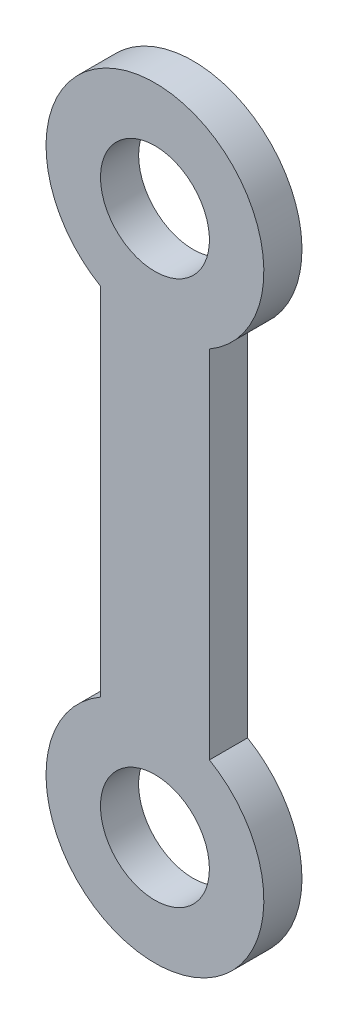
ISO-10303-21;
HEADER;
FILE_DESCRIPTION(('STEP AP214'),'2;1');
FILE_NAME('part.step','',(''),(''),'','','');
FILE_SCHEMA(('AUTOMOTIVE_DESIGN { 1 0 10303 214 1 1 1 1 }'));
ENDSEC;
DATA;
#1=APPLICATION_CONTEXT('core data for automotive mechanical design processes');
#2=APPLICATION_PROTOCOL_DEFINITION('international standard','automotive_design',2000,#1);
#3=PRODUCT_CONTEXT('',#1,'mechanical');
#4=PRODUCT('Part','Part','',(#3));
#5=PRODUCT_RELATED_PRODUCT_CATEGORY('part','',(#4));
#6=PRODUCT_DEFINITION_FORMATION('','',#4);
#7=PRODUCT_DEFINITION_CONTEXT('part definition',#1,'design');
#8=PRODUCT_DEFINITION('design','',#6,#7);
#9=PRODUCT_DEFINITION_SHAPE('','',#8);
#10=(LENGTH_UNIT() NAMED_UNIT(*) SI_UNIT(.MILLI.,.METRE.));
#11=(NAMED_UNIT(*) PLANE_ANGLE_UNIT() SI_UNIT($,.RADIAN.));
#12=(NAMED_UNIT(*) SI_UNIT($,.STERADIAN.) SOLID_ANGLE_UNIT());
#13=UNCERTAINTY_MEASURE_WITH_UNIT(LENGTH_MEASURE(1.E-05),#10,'distance_accuracy_value','');
#14=(GEOMETRIC_REPRESENTATION_CONTEXT(3) GLOBAL_UNCERTAINTY_ASSIGNED_CONTEXT((#13)) GLOBAL_UNIT_ASSIGNED_CONTEXT((#10,
#11,#12)) REPRESENTATION_CONTEXT('',''));
#15=CARTESIAN_POINT('',(0.,0.,0.));
#16=DIRECTION('',(0.,0.,1.));
#17=DIRECTION('',(1.,0.,0.));
#18=AXIS2_PLACEMENT_3D('',#15,#16,#17);
#19=CARTESIAN_POINT('',(0.,0.,1.4));
#20=DIRECTION('',(0.,0.,-1.));
#21=DIRECTION('',(-1.,0.,0.));
#22=AXIS2_PLACEMENT_3D('',#19,#20,#21);
#23=PLANE('',#22);
#24=CARTESIAN_POINT('',(0.,0.,1.4));
#25=DIRECTION('',(0.,0.,1.));
#26=DIRECTION('',(-1.,0.,0.));
#27=AXIS2_PLACEMENT_3D('',#24,#25,#26);
#28=CIRCLE('',#27,4.);
#29=CARTESIAN_POINT('',(-2.,3.46410161513776,1.4));
#30=VERTEX_POINT('',#29);
#31=CARTESIAN_POINT('',(2.,3.46410161513776,1.4));
#32=VERTEX_POINT('',#31);
#33=EDGE_CURVE('E92',#30,#32,#28,.T.);
#34=ORIENTED_EDGE('',*,*,#33,.T.);
#35=DIRECTION('',(0.,1.,0.));
#36=VECTOR('',#35,1.);
#37=CARTESIAN_POINT('',(2.,16.5358983848622,1.4));
#38=LINE('',#37,#36);
#39=CARTESIAN_POINT('',(1.99999999999999,16.5358983848622,1.4));
#40=VERTEX_POINT('',#39);
#41=EDGE_CURVE('E87',#32,#40,#38,.T.);
#42=ORIENTED_EDGE('',*,*,#41,.T.);
#43=CARTESIAN_POINT('',(0.,20.,1.4));
#44=DIRECTION('',(0.,0.,1.));
#45=DIRECTION('',(1.,0.,0.));
#46=AXIS2_PLACEMENT_3D('',#43,#44,#45);
#47=CIRCLE('',#46,4.);
#48=CARTESIAN_POINT('',(-2.,16.5358983848622,1.4));
#49=VERTEX_POINT('',#48);
#50=EDGE_CURVE('E90',#40,#49,#47,.T.);
#51=ORIENTED_EDGE('',*,*,#50,.T.);
#52=DIRECTION('',(0.,-1.,0.));
#53=VECTOR('',#52,1.);
#54=CARTESIAN_POINT('',(-2.,16.5358983848622,1.4));
#55=LINE('',#54,#53);
#56=EDGE_CURVE('E57',#49,#30,#55,.T.);
#57=ORIENTED_EDGE('',*,*,#56,.T.);
#58=EDGE_LOOP('',(#34,#42,#51,#57));
#59=FACE_BOUND('',#58,.T.);
#60=CARTESIAN_POINT('',(0.,0.,1.4));
#61=DIRECTION('',(0.,0.,1.));
#62=DIRECTION('',(1.,0.,0.));
#63=AXIS2_PLACEMENT_3D('',#60,#61,#62);
#64=CIRCLE('',#63,2.);
#65=CARTESIAN_POINT('',(2.,0.,1.4));
#66=VERTEX_POINT('',#65);
#67=EDGE_CURVE('E112',#66,#66,#64,.T.);
#68=ORIENTED_EDGE('',*,*,#67,.F.);
#69=EDGE_LOOP('',(#68));
#70=FACE_BOUND('',#69,.T.);
#71=CARTESIAN_POINT('',(0.,20.,1.4));
#72=DIRECTION('',(0.,0.,1.));
#73=DIRECTION('',(-1.,0.,0.));
#74=AXIS2_PLACEMENT_3D('',#71,#72,#73);
#75=CIRCLE('',#74,2.);
#76=CARTESIAN_POINT('',(-2.,20.,1.4));
#77=VERTEX_POINT('',#76);
#78=EDGE_CURVE('E134',#77,#77,#75,.T.);
#79=ORIENTED_EDGE('',*,*,#78,.F.);
#80=EDGE_LOOP('',(#79));
#81=FACE_BOUND('',#80,.T.);
#82=ADVANCED_FACE('F39',(#59,#70,#81),#23,.F.);
#83=CARTESIAN_POINT('',(0.,0.,0.));
#84=DIRECTION('',(0.,0.,-1.));
#85=DIRECTION('',(-1.,0.,0.));
#86=AXIS2_PLACEMENT_3D('',#83,#84,#85);
#87=PLANE('',#86);
#88=CARTESIAN_POINT('',(0.,0.,0.));
#89=DIRECTION('',(0.,0.,1.));
#90=DIRECTION('',(1.,0.,0.));
#91=AXIS2_PLACEMENT_3D('',#88,#89,#90);
#92=CIRCLE('',#91,2.);
#93=CARTESIAN_POINT('',(2.,0.,0.));
#94=VERTEX_POINT('',#93);
#95=EDGE_CURVE('E130',#94,#94,#92,.T.);
#96=ORIENTED_EDGE('',*,*,#95,.T.);
#97=EDGE_LOOP('',(#96));
#98=FACE_BOUND('',#97,.T.);
#99=CARTESIAN_POINT('',(0.,0.,0.));
#100=DIRECTION('',(0.,0.,1.));
#101=DIRECTION('',(-1.,0.,0.));
#102=AXIS2_PLACEMENT_3D('',#99,#100,#101);
#103=CIRCLE('',#102,4.);
#104=CARTESIAN_POINT('',(-2.,3.46410161513776,0.));
#105=VERTEX_POINT('',#104);
#106=CARTESIAN_POINT('',(2.,3.46410161513776,0.));
#107=VERTEX_POINT('',#106);
#108=EDGE_CURVE('E108',#105,#107,#103,.T.);
#109=ORIENTED_EDGE('',*,*,#108,.F.);
#110=DIRECTION('',(0.,-1.,0.));
#111=VECTOR('',#110,1.);
#112=CARTESIAN_POINT('',(-2.,16.5358983848622,0.));
#113=LINE('',#112,#111);
#114=CARTESIAN_POINT('',(-2.,16.5358983848622,0.));
#115=VERTEX_POINT('',#114);
#116=EDGE_CURVE('E80',#115,#105,#113,.T.);
#117=ORIENTED_EDGE('',*,*,#116,.F.);
#118=CARTESIAN_POINT('',(0.,20.,0.));
#119=DIRECTION('',(0.,0.,1.));
#120=DIRECTION('',(1.,0.,0.));
#121=AXIS2_PLACEMENT_3D('',#118,#119,#120);
#122=CIRCLE('',#121,4.);
#123=CARTESIAN_POINT('',(1.99999999999999,16.5358983848622,0.));
#124=VERTEX_POINT('',#123);
#125=EDGE_CURVE('E74',#124,#115,#122,.T.);
#126=ORIENTED_EDGE('',*,*,#125,.F.);
#127=DIRECTION('',(0.,1.,0.));
#128=VECTOR('',#127,1.);
#129=CARTESIAN_POINT('',(2.,16.5358983848622,0.));
#130=LINE('',#129,#128);
#131=EDGE_CURVE('E97',#107,#124,#130,.T.);
#132=ORIENTED_EDGE('',*,*,#131,.F.);
#133=EDGE_LOOP('',(#109,#117,#126,#132));
#134=FACE_BOUND('',#133,.T.);
#135=CARTESIAN_POINT('',(0.,20.,0.));
#136=DIRECTION('',(0.,0.,1.));
#137=DIRECTION('',(-1.,0.,0.));
#138=AXIS2_PLACEMENT_3D('',#135,#136,#137);
#139=CIRCLE('',#138,2.);
#140=CARTESIAN_POINT('',(-2.,20.,0.));
#141=VERTEX_POINT('',#140);
#142=EDGE_CURVE('E138',#141,#141,#139,.T.);
#143=ORIENTED_EDGE('',*,*,#142,.T.);
#144=EDGE_LOOP('',(#143));
#145=FACE_BOUND('',#144,.T.);
#146=ADVANCED_FACE('F125',(#98,#134,#145),#87,.T.);
#147=CARTESIAN_POINT('',(0.,0.,1.4));
#148=DIRECTION('',(0.,0.,-1.));
#149=DIRECTION('',(-1.,0.,0.));
#150=AXIS2_PLACEMENT_3D('',#147,#148,#149);
#151=CYLINDRICAL_SURFACE('',#150,4.);
#152=ORIENTED_EDGE('',*,*,#108,.T.);
#153=DIRECTION('',(0.,0.,-1.));
#154=VECTOR('',#153,1.);
#155=CARTESIAN_POINT('',(2.,3.46410161513776,1.4));
#156=LINE('',#155,#154);
#157=EDGE_CURVE('E11',#32,#107,#156,.T.);
#158=ORIENTED_EDGE('',*,*,#157,.F.);
#159=ORIENTED_EDGE('',*,*,#33,.F.);
#160=DIRECTION('',(0.,0.,-1.));
#161=VECTOR('',#160,1.);
#162=CARTESIAN_POINT('',(-2.,3.46410161513776,1.4));
#163=LINE('',#162,#161);
#164=EDGE_CURVE('E104',#30,#105,#163,.T.);
#165=ORIENTED_EDGE('',*,*,#164,.T.);
#166=EDGE_LOOP('',(#152,#158,#159,#165));
#167=FACE_BOUND('',#166,.T.);
#168=ADVANCED_FACE('F41',(#167),#151,.T.);
#169=CARTESIAN_POINT('',(2.,16.5358983848622,1.4));
#170=DIRECTION('',(-1.,0.,0.));
#171=DIRECTION('',(0.,-1.,0.));
#172=AXIS2_PLACEMENT_3D('',#169,#170,#171);
#173=PLANE('',#172);
#174=ORIENTED_EDGE('',*,*,#131,.T.);
#175=DIRECTION('',(0.,0.,-1.));
#176=VECTOR('',#175,1.);
#177=CARTESIAN_POINT('',(1.99999999999999,16.5358983848622,1.4));
#178=LINE('',#177,#176);
#179=EDGE_CURVE('E49',#40,#124,#178,.T.);
#180=ORIENTED_EDGE('',*,*,#179,.F.);
#181=ORIENTED_EDGE('',*,*,#41,.F.);
#182=ORIENTED_EDGE('',*,*,#157,.T.);
#183=EDGE_LOOP('',(#174,#180,#181,#182));
#184=FACE_BOUND('',#183,.T.);
#185=ADVANCED_FACE('F96',(#184),#173,.F.);
#186=CARTESIAN_POINT('',(0.,20.,1.4));
#187=DIRECTION('',(0.,0.,-1.));
#188=DIRECTION('',(-1.,0.,0.));
#189=AXIS2_PLACEMENT_3D('',#186,#187,#188);
#190=CYLINDRICAL_SURFACE('',#189,4.);
#191=ORIENTED_EDGE('',*,*,#125,.T.);
#192=DIRECTION('',(0.,0.,-1.));
#193=VECTOR('',#192,1.);
#194=CARTESIAN_POINT('',(-2.,16.5358983848622,1.4));
#195=LINE('',#194,#193);
#196=EDGE_CURVE('E99',#49,#115,#195,.T.);
#197=ORIENTED_EDGE('',*,*,#196,.F.);
#198=ORIENTED_EDGE('',*,*,#50,.F.);
#199=ORIENTED_EDGE('',*,*,#179,.T.);
#200=EDGE_LOOP('',(#191,#197,#198,#199));
#201=FACE_BOUND('',#200,.T.);
#202=ADVANCED_FACE('F100',(#201),#190,.T.);
#203=CARTESIAN_POINT('',(-2.,16.5358983848622,1.4));
#204=DIRECTION('',(1.,0.,0.));
#205=DIRECTION('',(0.,0.,-1.));
#206=AXIS2_PLACEMENT_3D('',#203,#204,#205);
#207=PLANE('',#206);
#208=ORIENTED_EDGE('',*,*,#116,.T.);
#209=ORIENTED_EDGE('',*,*,#164,.F.);
#210=ORIENTED_EDGE('',*,*,#56,.F.);
#211=ORIENTED_EDGE('',*,*,#196,.T.);
#212=EDGE_LOOP('',(#208,#209,#210,#211));
#213=FACE_BOUND('',#212,.T.);
#214=ADVANCED_FACE('F122',(#213),#207,.F.);
#215=CARTESIAN_POINT('',(0.,0.,1.4));
#216=DIRECTION('',(0.,0.,-1.));
#217=DIRECTION('',(-1.,0.,0.));
#218=AXIS2_PLACEMENT_3D('',#215,#216,#217);
#219=CYLINDRICAL_SURFACE('',#218,2.);
#220=ORIENTED_EDGE('',*,*,#67,.T.);
#221=EDGE_LOOP('',(#220));
#222=FACE_BOUND('',#221,.T.);
#223=ORIENTED_EDGE('',*,*,#95,.F.);
#224=EDGE_LOOP('',(#223));
#225=FACE_BOUND('',#224,.T.);
#226=ADVANCED_FACE('F157',(#222,#225),#219,.F.);
#227=CARTESIAN_POINT('',(0.,20.,1.4));
#228=DIRECTION('',(0.,0.,-1.));
#229=DIRECTION('',(-1.,0.,0.));
#230=AXIS2_PLACEMENT_3D('',#227,#228,#229);
#231=CYLINDRICAL_SURFACE('',#230,2.);
#232=ORIENTED_EDGE('',*,*,#78,.T.);
#233=EDGE_LOOP('',(#232));
#234=FACE_BOUND('',#233,.T.);
#235=ORIENTED_EDGE('',*,*,#142,.F.);
#236=EDGE_LOOP('',(#235));
#237=FACE_BOUND('',#236,.T.);
#238=ADVANCED_FACE('F146',(#234,#237),#231,.F.);
#239=CLOSED_SHELL('',(#82,#146,#168,#185,#202,#214,#226,#238));
#240=MANIFOLD_SOLID_BREP('B2',#239);
#241=ADVANCED_BREP_SHAPE_REPRESENTATION('',(#18,#240),#14);
#242=SHAPE_DEFINITION_REPRESENTATION(#9,#241);
ENDSEC;
END-ISO-10303-21;
